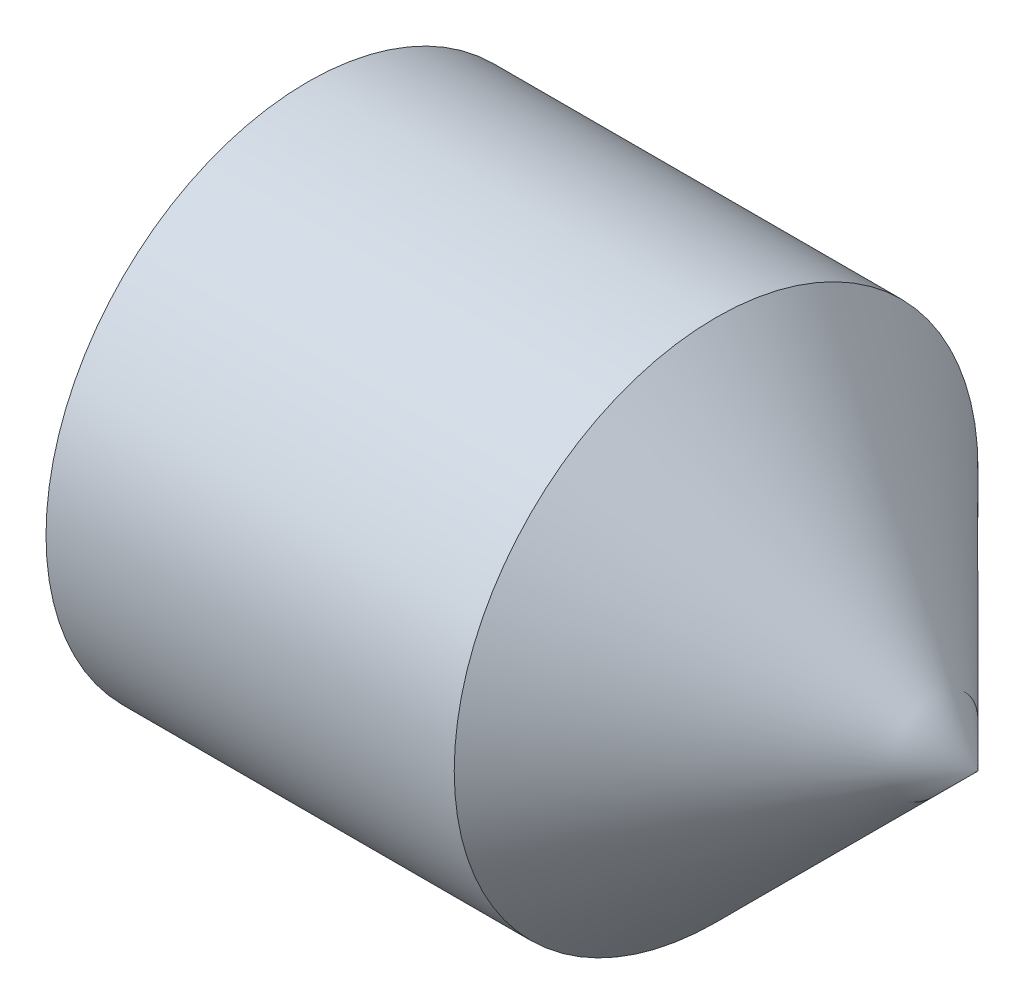
ISO-10303-21;
HEADER;
FILE_DESCRIPTION(('STEP AP214'),'2;1');
FILE_NAME('part.step','',(''),(''),'','','');
FILE_SCHEMA(('AUTOMOTIVE_DESIGN { 1 0 10303 214 1 1 1 1 }'));
ENDSEC;
DATA;
#1=APPLICATION_CONTEXT('core data for automotive mechanical design processes');
#2=APPLICATION_PROTOCOL_DEFINITION('international standard','automotive_design',2000,#1);
#3=PRODUCT_CONTEXT('',#1,'mechanical');
#4=PRODUCT('Part','Part','',(#3));
#5=PRODUCT_RELATED_PRODUCT_CATEGORY('part','',(#4));
#6=PRODUCT_DEFINITION_FORMATION('','',#4);
#7=PRODUCT_DEFINITION_CONTEXT('part definition',#1,'design');
#8=PRODUCT_DEFINITION('design','',#6,#7);
#9=PRODUCT_DEFINITION_SHAPE('','',#8);
#10=(LENGTH_UNIT() NAMED_UNIT(*) SI_UNIT(.MILLI.,.METRE.));
#11=(NAMED_UNIT(*) PLANE_ANGLE_UNIT() SI_UNIT($,.RADIAN.));
#12=(NAMED_UNIT(*) SI_UNIT($,.STERADIAN.) SOLID_ANGLE_UNIT());
#13=UNCERTAINTY_MEASURE_WITH_UNIT(LENGTH_MEASURE(1.E-05),#10,'distance_accuracy_value','');
#14=(GEOMETRIC_REPRESENTATION_CONTEXT(3) GLOBAL_UNCERTAINTY_ASSIGNED_CONTEXT((#13)) GLOBAL_UNIT_ASSIGNED_CONTEXT((#10,
#11,#12)) REPRESENTATION_CONTEXT('',''));
#15=CARTESIAN_POINT('',(0.,0.,0.));
#16=DIRECTION('',(0.,0.,1.));
#17=DIRECTION('',(1.,0.,0.));
#18=AXIS2_PLACEMENT_3D('',#15,#16,#17);
#19=CARTESIAN_POINT('',(0.,0.,0.));
#20=DIRECTION('',(-1.,0.,0.));
#21=DIRECTION('',(0.,0.,1.));
#22=AXIS2_PLACEMENT_3D('',#19,#20,#21);
#23=PLANE('',#22);
#24=CARTESIAN_POINT('',(0.,0.,0.));
#25=DIRECTION('',(-1.,0.,0.));
#26=DIRECTION('',(0.,0.,1.));
#27=AXIS2_PLACEMENT_3D('',#24,#25,#26);
#28=CIRCLE('',#27,1.2195);
#29=CARTESIAN_POINT('',(0.,0.,1.2195));
#30=VERTEX_POINT('',#29);
#31=EDGE_CURVE('E11',#30,#30,#28,.T.);
#32=ORIENTED_EDGE('',*,*,#31,.T.);
#33=EDGE_LOOP('',(#32));
#34=FACE_BOUND('',#33,.T.);
#35=DIRECTION('',(0.,0.,-1.));
#36=VECTOR('',#35,1.);
#37=CARTESIAN_POINT('',(0.,0.750000000000003,0.433012701892217));
#38=LINE('',#37,#36);
#39=CARTESIAN_POINT('',(0.,0.750000000000003,0.433012701892217));
#40=VERTEX_POINT('',#39);
#41=CARTESIAN_POINT('',(0.,0.750000000000003,-0.433012701892222));
#42=VERTEX_POINT('',#41);
#43=EDGE_CURVE('E95',#40,#42,#38,.T.);
#44=ORIENTED_EDGE('',*,*,#43,.F.);
#45=DIRECTION('',(0.,-0.866025403784439,0.5));
#46=VECTOR('',#45,1.);
#47=CARTESIAN_POINT('',(0.,0.750000000000003,0.433012701892217));
#48=LINE('',#47,#46);
#49=CARTESIAN_POINT('',(0.,0.,0.866025403784436));
#50=VERTEX_POINT('',#49);
#51=EDGE_CURVE('E48',#40,#50,#48,.T.);
#52=ORIENTED_EDGE('',*,*,#51,.T.);
#53=DIRECTION('',(0.,0.866025403784439,0.5));
#54=VECTOR('',#53,1.);
#55=CARTESIAN_POINT('',(0.,-0.749999999999997,0.433012701892217));
#56=LINE('',#55,#54);
#57=CARTESIAN_POINT('',(0.,-0.749999999999997,0.433012701892217));
#58=VERTEX_POINT('',#57);
#59=EDGE_CURVE('E101',#58,#50,#56,.T.);
#60=ORIENTED_EDGE('',*,*,#59,.F.);
#61=DIRECTION('',(0.,0.,-1.));
#62=VECTOR('',#61,1.);
#63=CARTESIAN_POINT('',(0.,-0.749999999999997,0.433012701892217));
#64=LINE('',#63,#62);
#65=CARTESIAN_POINT('',(0.,-0.749999999999997,-0.433012701892222));
#66=VERTEX_POINT('',#65);
#67=EDGE_CURVE('E121',#58,#66,#64,.T.);
#68=ORIENTED_EDGE('',*,*,#67,.T.);
#69=DIRECTION('',(0.,0.866025403784438,-0.5));
#70=VECTOR('',#69,1.);
#71=CARTESIAN_POINT('',(0.,-0.749999999999997,-0.433012701892222));
#72=LINE('',#71,#70);
#73=CARTESIAN_POINT('',(0.,0.,-0.866025403784441));
#74=VERTEX_POINT('',#73);
#75=EDGE_CURVE('E124',#66,#74,#72,.T.);
#76=ORIENTED_EDGE('',*,*,#75,.T.);
#77=DIRECTION('',(0.,-0.866025403784439,-0.5));
#78=VECTOR('',#77,1.);
#79=CARTESIAN_POINT('',(0.,0.750000000000003,-0.433012701892222));
#80=LINE('',#79,#78);
#81=EDGE_CURVE('E127',#42,#74,#80,.T.);
#82=ORIENTED_EDGE('',*,*,#81,.F.);
#83=EDGE_LOOP('',(#44,#52,#60,#68,#76,#82));
#84=FACE_BOUND('',#83,.T.);
#85=ADVANCED_FACE('F34',(#34,#84),#23,.T.);
#86=CARTESIAN_POINT('',(0.,0.,0.));
#87=DIRECTION('',(1.,0.,0.));
#88=DIRECTION('',(0.,0.,-1.));
#89=AXIS2_PLACEMENT_3D('',#86,#87,#88);
#90=CONICAL_SURFACE('',#89,1.2195,1.0471975511966);
#91=CARTESIAN_POINT('',(0.161946750507689,0.,0.));
#92=DIRECTION('',(-1.,0.,0.));
#93=DIRECTION('',(0.,0.,1.));
#94=AXIS2_PLACEMENT_3D('',#91,#92,#93);
#95=CIRCLE('',#94,1.5);
#96=CARTESIAN_POINT('',(0.161946750507689,0.,1.5));
#97=VERTEX_POINT('',#96);
#98=EDGE_CURVE('E41',#97,#97,#95,.T.);
#99=ORIENTED_EDGE('',*,*,#98,.T.);
#100=EDGE_LOOP('',(#99));
#101=FACE_BOUND('',#100,.T.);
#102=ORIENTED_EDGE('',*,*,#31,.F.);
#103=EDGE_LOOP('',(#102));
#104=FACE_BOUND('',#103,.T.);
#105=ADVANCED_FACE('F144',(#101,#104),#90,.T.);
#106=CARTESIAN_POINT('',(-12.7,0.,0.));
#107=DIRECTION('',(-1.,0.,0.));
#108=DIRECTION('',(0.,0.,1.));
#109=AXIS2_PLACEMENT_3D('',#106,#107,#108);
#110=CYLINDRICAL_SURFACE('',#109,1.5);
#111=CARTESIAN_POINT('',(2.50000000000001,0.,0.));
#112=DIRECTION('',(-1.,0.,0.));
#113=DIRECTION('',(0.,0.,1.));
#114=AXIS2_PLACEMENT_3D('',#111,#112,#113);
#115=CIRCLE('',#114,1.5);
#116=CARTESIAN_POINT('',(2.50000000000001,0.,1.5));
#117=VERTEX_POINT('',#116);
#118=EDGE_CURVE('E102',#117,#117,#115,.T.);
#119=ORIENTED_EDGE('',*,*,#118,.T.);
#120=EDGE_LOOP('',(#119));
#121=FACE_BOUND('',#120,.T.);
#122=ORIENTED_EDGE('',*,*,#98,.F.);
#123=EDGE_LOOP('',(#122));
#124=FACE_BOUND('',#123,.T.);
#125=ADVANCED_FACE('F147',(#121,#124),#110,.T.);
#126=CARTESIAN_POINT('',(2.50000000000001,0.,0.));
#127=DIRECTION('',(-1.,0.,0.));
#128=DIRECTION('',(0.,0.,1.));
#129=AXIS2_PLACEMENT_3D('',#126,#127,#128);
#130=CONICAL_SURFACE('',#129,1.5,0.785398163397451);
#131=CARTESIAN_POINT('',(4.,0.,0.));
#132=VERTEX_POINT('',#131);
#133=VERTEX_LOOP('',#132);
#134=FACE_BOUND('',#133,.T.);
#135=ORIENTED_EDGE('',*,*,#118,.F.);
#136=EDGE_LOOP('',(#135));
#137=FACE_BOUND('',#136,.T.);
#138=ADVANCED_FACE('F149',(#134,#137),#130,.T.);
#139=CARTESIAN_POINT('',(2.,0.750000000000003,0.433012701892217));
#140=DIRECTION('',(0.,-0.5,-0.866025403784439));
#141=DIRECTION('',(0.,0.866025403784439,-0.5));
#142=AXIS2_PLACEMENT_3D('',#139,#140,#141);
#143=PLANE('',#142);
#144=ORIENTED_EDGE('',*,*,#51,.F.);
#145=DIRECTION('',(-1.,0.,0.));
#146=VECTOR('',#145,1.);
#147=CARTESIAN_POINT('',(2.,0.750000000000003,0.433012701892217));
#148=LINE('',#147,#146);
#149=CARTESIAN_POINT('',(2.,0.750000000000003,0.433012701892217));
#150=VERTEX_POINT('',#149);
#151=EDGE_CURVE('E89',#150,#40,#148,.T.);
#152=ORIENTED_EDGE('',*,*,#151,.F.);
#153=DIRECTION('',(0.,-0.866025403784439,0.5));
#154=VECTOR('',#153,1.);
#155=CARTESIAN_POINT('',(2.,0.750000000000003,0.433012701892217));
#156=LINE('',#155,#154);
#157=CARTESIAN_POINT('',(2.,0.,0.866025403784436));
#158=VERTEX_POINT('',#157);
#159=EDGE_CURVE('E84',#150,#158,#156,.T.);
#160=ORIENTED_EDGE('',*,*,#159,.T.);
#161=DIRECTION('',(-1.,0.,0.));
#162=VECTOR('',#161,1.);
#163=CARTESIAN_POINT('',(2.,0.,0.866025403784436));
#164=LINE('',#163,#162);
#165=EDGE_CURVE('E87',#158,#50,#164,.T.);
#166=ORIENTED_EDGE('',*,*,#165,.T.);
#167=EDGE_LOOP('',(#144,#152,#160,#166));
#168=FACE_BOUND('',#167,.T.);
#169=ADVANCED_FACE('F86',(#168),#143,.T.);
#170=CARTESIAN_POINT('',(2.,-0.749999999999997,0.433012701892217));
#171=DIRECTION('',(0.,-0.5,0.866025403784439));
#172=DIRECTION('',(0.,-0.866025403784439,-0.5));
#173=AXIS2_PLACEMENT_3D('',#170,#171,#172);
#174=PLANE('',#173);
#175=ORIENTED_EDGE('',*,*,#59,.T.);
#176=ORIENTED_EDGE('',*,*,#165,.F.);
#177=DIRECTION('',(0.,0.866025403784439,0.5));
#178=VECTOR('',#177,1.);
#179=CARTESIAN_POINT('',(2.,-0.749999999999997,0.433012701892217));
#180=LINE('',#179,#178);
#181=CARTESIAN_POINT('',(2.,-0.749999999999997,0.433012701892217));
#182=VERTEX_POINT('',#181);
#183=EDGE_CURVE('E94',#182,#158,#180,.T.);
#184=ORIENTED_EDGE('',*,*,#183,.F.);
#185=DIRECTION('',(-1.,0.,0.));
#186=VECTOR('',#185,1.);
#187=CARTESIAN_POINT('',(2.,-0.749999999999997,0.433012701892217));
#188=LINE('',#187,#186);
#189=EDGE_CURVE('E103',#182,#58,#188,.T.);
#190=ORIENTED_EDGE('',*,*,#189,.T.);
#191=EDGE_LOOP('',(#175,#176,#184,#190));
#192=FACE_BOUND('',#191,.T.);
#193=ADVANCED_FACE('F99',(#192),#174,.F.);
#194=CARTESIAN_POINT('',(2.,-0.749999999999997,0.433012701892217));
#195=DIRECTION('',(0.,1.,0.));
#196=DIRECTION('',(0.,0.,1.));
#197=AXIS2_PLACEMENT_3D('',#194,#195,#196);
#198=PLANE('',#197);
#199=ORIENTED_EDGE('',*,*,#67,.F.);
#200=ORIENTED_EDGE('',*,*,#189,.F.);
#201=DIRECTION('',(0.,0.,-1.));
#202=VECTOR('',#201,1.);
#203=CARTESIAN_POINT('',(2.,-0.749999999999997,0.433012701892217));
#204=LINE('',#203,#202);
#205=CARTESIAN_POINT('',(2.,-0.749999999999997,-0.433012701892222));
#206=VERTEX_POINT('',#205);
#207=EDGE_CURVE('E108',#182,#206,#204,.T.);
#208=ORIENTED_EDGE('',*,*,#207,.T.);
#209=DIRECTION('',(-1.,0.,0.));
#210=VECTOR('',#209,1.);
#211=CARTESIAN_POINT('',(2.,-0.749999999999997,-0.433012701892222));
#212=LINE('',#211,#210);
#213=EDGE_CURVE('E137',#206,#66,#212,.T.);
#214=ORIENTED_EDGE('',*,*,#213,.T.);
#215=EDGE_LOOP('',(#199,#200,#208,#214));
#216=FACE_BOUND('',#215,.T.);
#217=ADVANCED_FACE('F177',(#216),#198,.T.);
#218=CARTESIAN_POINT('',(2.,-0.749999999999997,-0.433012701892222));
#219=DIRECTION('',(0.,0.5,0.866025403784438));
#220=DIRECTION('',(0.,-0.866025403784439,0.5));
#221=AXIS2_PLACEMENT_3D('',#218,#219,#220);
#222=PLANE('',#221);
#223=ORIENTED_EDGE('',*,*,#75,.F.);
#224=ORIENTED_EDGE('',*,*,#213,.F.);
#225=DIRECTION('',(0.,0.866025403784438,-0.5));
#226=VECTOR('',#225,1.);
#227=CARTESIAN_POINT('',(2.,-0.749999999999997,-0.433012701892222));
#228=LINE('',#227,#226);
#229=CARTESIAN_POINT('',(2.,0.,-0.866025403784441));
#230=VERTEX_POINT('',#229);
#231=EDGE_CURVE('E110',#206,#230,#228,.T.);
#232=ORIENTED_EDGE('',*,*,#231,.T.);
#233=DIRECTION('',(-1.,0.,0.));
#234=VECTOR('',#233,1.);
#235=CARTESIAN_POINT('',(2.,0.,-0.866025403784441));
#236=LINE('',#235,#234);
#237=EDGE_CURVE('E135',#230,#74,#236,.T.);
#238=ORIENTED_EDGE('',*,*,#237,.T.);
#239=EDGE_LOOP('',(#223,#224,#232,#238));
#240=FACE_BOUND('',#239,.T.);
#241=ADVANCED_FACE('F173',(#240),#222,.T.);
#242=CARTESIAN_POINT('',(2.,0.750000000000003,-0.433012701892222));
#243=DIRECTION('',(0.,0.5,-0.866025403784439));
#244=DIRECTION('',(0.,0.866025403784439,0.5));
#245=AXIS2_PLACEMENT_3D('',#242,#243,#244);
#246=PLANE('',#245);
#247=ORIENTED_EDGE('',*,*,#81,.T.);
#248=ORIENTED_EDGE('',*,*,#237,.F.);
#249=DIRECTION('',(0.,-0.866025403784439,-0.5));
#250=VECTOR('',#249,1.);
#251=CARTESIAN_POINT('',(2.,0.750000000000003,-0.433012701892222));
#252=LINE('',#251,#250);
#253=CARTESIAN_POINT('',(2.,0.750000000000003,-0.433012701892222));
#254=VERTEX_POINT('',#253);
#255=EDGE_CURVE('E114',#254,#230,#252,.T.);
#256=ORIENTED_EDGE('',*,*,#255,.F.);
#257=DIRECTION('',(-1.,0.,0.));
#258=VECTOR('',#257,1.);
#259=CARTESIAN_POINT('',(2.,0.750000000000003,-0.433012701892222));
#260=LINE('',#259,#258);
#261=EDGE_CURVE('E133',#254,#42,#260,.T.);
#262=ORIENTED_EDGE('',*,*,#261,.T.);
#263=EDGE_LOOP('',(#247,#248,#256,#262));
#264=FACE_BOUND('',#263,.T.);
#265=ADVANCED_FACE('F170',(#264),#246,.F.);
#266=CARTESIAN_POINT('',(2.,0.750000000000003,0.433012701892217));
#267=DIRECTION('',(0.,1.,0.));
#268=DIRECTION('',(0.,0.,1.));
#269=AXIS2_PLACEMENT_3D('',#266,#267,#268);
#270=PLANE('',#269);
#271=ORIENTED_EDGE('',*,*,#43,.T.);
#272=ORIENTED_EDGE('',*,*,#261,.F.);
#273=DIRECTION('',(0.,0.,-1.));
#274=VECTOR('',#273,1.);
#275=CARTESIAN_POINT('',(2.,0.750000000000003,0.433012701892217));
#276=LINE('',#275,#274);
#277=EDGE_CURVE('E117',#150,#254,#276,.T.);
#278=ORIENTED_EDGE('',*,*,#277,.F.);
#279=ORIENTED_EDGE('',*,*,#151,.T.);
#280=EDGE_LOOP('',(#271,#272,#278,#279));
#281=FACE_BOUND('',#280,.T.);
#282=ADVANCED_FACE('F166',(#281),#270,.F.);
#283=CARTESIAN_POINT('',(2.,0.750000000000003,0.433012701892217));
#284=DIRECTION('',(1.,0.,0.));
#285=DIRECTION('',(0.,0.,-1.));
#286=AXIS2_PLACEMENT_3D('',#283,#284,#285);
#287=PLANE('',#286);
#288=ORIENTED_EDGE('',*,*,#159,.F.);
#289=ORIENTED_EDGE('',*,*,#277,.T.);
#290=ORIENTED_EDGE('',*,*,#255,.T.);
#291=ORIENTED_EDGE('',*,*,#231,.F.);
#292=ORIENTED_EDGE('',*,*,#207,.F.);
#293=ORIENTED_EDGE('',*,*,#183,.T.);
#294=EDGE_LOOP('',(#288,#289,#290,#291,#292,#293));
#295=FACE_BOUND('',#294,.T.);
#296=ADVANCED_FACE('F106',(#295),#287,.F.);
#297=CLOSED_SHELL('',(#85,#105,#125,#138,#169,#193,#217,#241,#265,#282,#296));
#298=MANIFOLD_SOLID_BREP('B2',#297);
#299=ADVANCED_BREP_SHAPE_REPRESENTATION('',(#18,#298),#14);
#300=SHAPE_DEFINITION_REPRESENTATION(#9,#299);
ENDSEC;
END-ISO-10303-21;
